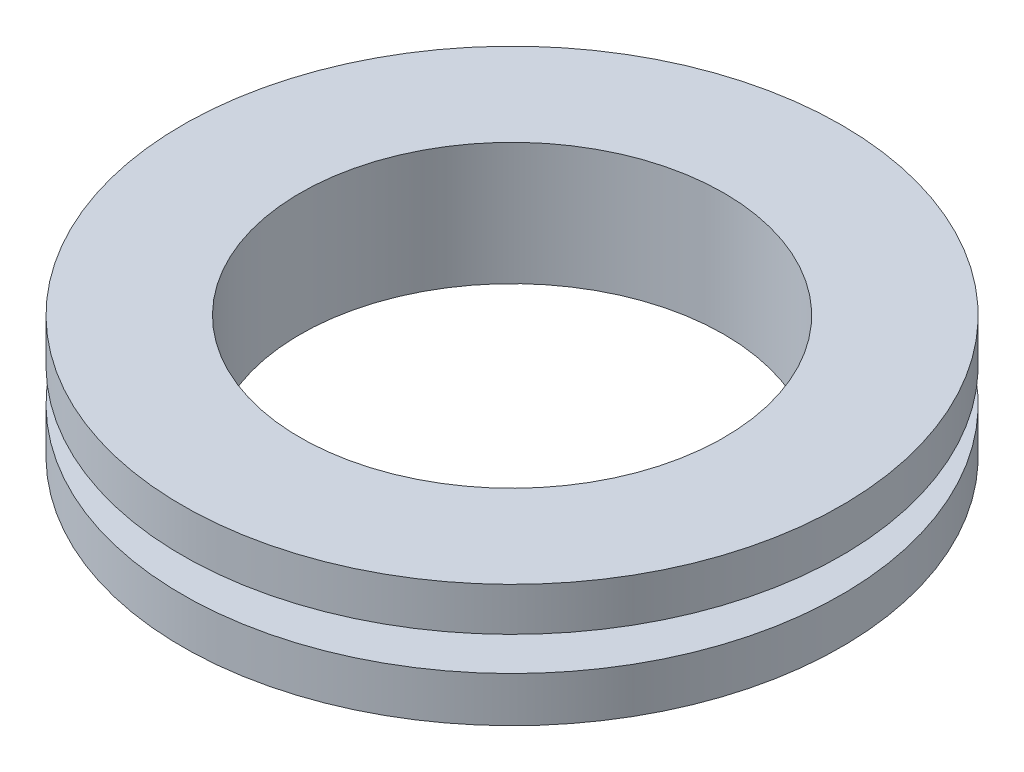
ISO-10303-21;
HEADER;
FILE_DESCRIPTION(('STEP AP214'),'2;1');
FILE_NAME('part.step','',(''),(''),'','','');
FILE_SCHEMA(('AUTOMOTIVE_DESIGN { 1 0 10303 214 1 1 1 1 }'));
ENDSEC;
DATA;
#1=APPLICATION_CONTEXT('core data for automotive mechanical design processes');
#2=APPLICATION_PROTOCOL_DEFINITION('international standard','automotive_design',2000,#1);
#3=PRODUCT_CONTEXT('',#1,'mechanical');
#4=PRODUCT('Part','Part','',(#3));
#5=PRODUCT_RELATED_PRODUCT_CATEGORY('part','',(#4));
#6=PRODUCT_DEFINITION_FORMATION('','',#4);
#7=PRODUCT_DEFINITION_CONTEXT('part definition',#1,'design');
#8=PRODUCT_DEFINITION('design','',#6,#7);
#9=PRODUCT_DEFINITION_SHAPE('','',#8);
#10=(LENGTH_UNIT() NAMED_UNIT(*) SI_UNIT(.MILLI.,.METRE.));
#11=(NAMED_UNIT(*) PLANE_ANGLE_UNIT() SI_UNIT($,.RADIAN.));
#12=(NAMED_UNIT(*) SI_UNIT($,.STERADIAN.) SOLID_ANGLE_UNIT());
#13=UNCERTAINTY_MEASURE_WITH_UNIT(LENGTH_MEASURE(1.E-05),#10,'distance_accuracy_value','');
#14=(GEOMETRIC_REPRESENTATION_CONTEXT(3) GLOBAL_UNCERTAINTY_ASSIGNED_CONTEXT((#13)) GLOBAL_UNIT_ASSIGNED_CONTEXT((#10,
#11,#12)) REPRESENTATION_CONTEXT('',''));
#15=CARTESIAN_POINT('',(0.,0.,0.));
#16=DIRECTION('',(0.,0.,1.));
#17=DIRECTION('',(1.,0.,0.));
#18=AXIS2_PLACEMENT_3D('',#15,#16,#17);
#19=CARTESIAN_POINT('',(0.,0.,0.));
#20=DIRECTION('',(0.,-1.,0.));
#21=DIRECTION('',(0.,0.,-1.));
#22=AXIS2_PLACEMENT_3D('',#19,#20,#21);
#23=CYLINDRICAL_SURFACE('',#22,11.25);
#24=CARTESIAN_POINT('',(0.,0.,0.));
#25=DIRECTION('',(0.,-1.,0.));
#26=DIRECTION('',(0.,0.,-1.));
#27=AXIS2_PLACEMENT_3D('',#24,#25,#26);
#28=CIRCLE('',#27,11.25);
#29=CARTESIAN_POINT('',(0.,0.,-11.25));
#30=VERTEX_POINT('',#29);
#31=EDGE_CURVE('E60',#30,#30,#28,.T.);
#32=ORIENTED_EDGE('',*,*,#31,.T.);
#33=EDGE_LOOP('',(#32));
#34=FACE_BOUND('',#33,.T.);
#35=CARTESIAN_POINT('',(0.,6.5,0.));
#36=DIRECTION('',(0.,-1.,0.));
#37=DIRECTION('',(0.,0.,-1.));
#38=AXIS2_PLACEMENT_3D('',#35,#36,#37);
#39=CIRCLE('',#38,11.25);
#40=CARTESIAN_POINT('',(0.,6.5,-11.25));
#41=VERTEX_POINT('',#40);
#42=EDGE_CURVE('E10',#41,#41,#39,.T.);
#43=ORIENTED_EDGE('',*,*,#42,.F.);
#44=EDGE_LOOP('',(#43));
#45=FACE_BOUND('',#44,.T.);
#46=ADVANCED_FACE('F32',(#34,#45),#23,.F.);
#47=CARTESIAN_POINT('',(11.25,6.5,0.));
#48=DIRECTION('',(0.,1.,0.));
#49=DIRECTION('',(0.,0.,1.));
#50=AXIS2_PLACEMENT_3D('',#47,#48,#49);
#51=PLANE('',#50);
#52=ORIENTED_EDGE('',*,*,#42,.T.);
#53=EDGE_LOOP('',(#52));
#54=FACE_BOUND('',#53,.T.);
#55=CARTESIAN_POINT('',(0.,6.5,0.));
#56=DIRECTION('',(0.,-1.,0.));
#57=DIRECTION('',(0.,0.,-1.));
#58=AXIS2_PLACEMENT_3D('',#55,#56,#57);
#59=CIRCLE('',#58,17.5);
#60=CARTESIAN_POINT('',(0.,6.5,-17.5));
#61=VERTEX_POINT('',#60);
#62=EDGE_CURVE('E38',#61,#61,#59,.T.);
#63=ORIENTED_EDGE('',*,*,#62,.F.);
#64=EDGE_LOOP('',(#63));
#65=FACE_BOUND('',#64,.T.);
#66=ADVANCED_FACE('F78',(#54,#65),#51,.T.);
#67=CARTESIAN_POINT('',(0.,0.,0.));
#68=DIRECTION('',(0.,-1.,0.));
#69=DIRECTION('',(0.,0.,-1.));
#70=AXIS2_PLACEMENT_3D('',#67,#68,#69);
#71=CYLINDRICAL_SURFACE('',#70,17.5);
#72=ORIENTED_EDGE('',*,*,#62,.T.);
#73=EDGE_LOOP('',(#72));
#74=FACE_BOUND('',#73,.T.);
#75=CARTESIAN_POINT('',(0.,4.2,0.));
#76=DIRECTION('',(0.,-1.,0.));
#77=DIRECTION('',(0.,0.,-1.));
#78=AXIS2_PLACEMENT_3D('',#75,#76,#77);
#79=CIRCLE('',#78,17.5);
#80=CARTESIAN_POINT('',(0.,4.2,-17.5));
#81=VERTEX_POINT('',#80);
#82=EDGE_CURVE('E42',#81,#81,#79,.T.);
#83=ORIENTED_EDGE('',*,*,#82,.F.);
#84=EDGE_LOOP('',(#83));
#85=FACE_BOUND('',#84,.T.);
#86=ADVANCED_FACE('F82',(#74,#85),#71,.T.);
#87=CARTESIAN_POINT('',(14.75,4.2,0.));
#88=DIRECTION('',(0.,-1.,0.));
#89=DIRECTION('',(0.,0.,-1.));
#90=AXIS2_PLACEMENT_3D('',#87,#88,#89);
#91=PLANE('',#90);
#92=ORIENTED_EDGE('',*,*,#82,.T.);
#93=EDGE_LOOP('',(#92));
#94=FACE_BOUND('',#93,.T.);
#95=CARTESIAN_POINT('',(0.,4.2,0.));
#96=DIRECTION('',(0.,-1.,0.));
#97=DIRECTION('',(0.,0.,-1.));
#98=AXIS2_PLACEMENT_3D('',#95,#96,#97);
#99=CIRCLE('',#98,14.75);
#100=CARTESIAN_POINT('',(0.,4.2,-14.75));
#101=VERTEX_POINT('',#100);
#102=EDGE_CURVE('E46',#101,#101,#99,.T.);
#103=ORIENTED_EDGE('',*,*,#102,.F.);
#104=EDGE_LOOP('',(#103));
#105=FACE_BOUND('',#104,.T.);
#106=ADVANCED_FACE('F86',(#94,#105),#91,.T.);
#107=CARTESIAN_POINT('',(0.,0.,0.));
#108=DIRECTION('',(0.,-1.,0.));
#109=DIRECTION('',(0.,0.,-1.));
#110=AXIS2_PLACEMENT_3D('',#107,#108,#109);
#111=CYLINDRICAL_SURFACE('',#110,14.75);
#112=ORIENTED_EDGE('',*,*,#102,.T.);
#113=EDGE_LOOP('',(#112));
#114=FACE_BOUND('',#113,.T.);
#115=CARTESIAN_POINT('',(0.,2.4,0.));
#116=DIRECTION('',(0.,-1.,0.));
#117=DIRECTION('',(0.,0.,-1.));
#118=AXIS2_PLACEMENT_3D('',#115,#116,#117);
#119=CIRCLE('',#118,14.75);
#120=CARTESIAN_POINT('',(0.,2.4,-14.75));
#121=VERTEX_POINT('',#120);
#122=EDGE_CURVE('E51',#121,#121,#119,.T.);
#123=ORIENTED_EDGE('',*,*,#122,.F.);
#124=EDGE_LOOP('',(#123));
#125=FACE_BOUND('',#124,.T.);
#126=ADVANCED_FACE('F92',(#114,#125),#111,.T.);
#127=CARTESIAN_POINT('',(17.5,2.4,0.));
#128=DIRECTION('',(0.,1.,0.));
#129=DIRECTION('',(0.,0.,1.));
#130=AXIS2_PLACEMENT_3D('',#127,#128,#129);
#131=PLANE('',#130);
#132=ORIENTED_EDGE('',*,*,#122,.T.);
#133=EDGE_LOOP('',(#132));
#134=FACE_BOUND('',#133,.T.);
#135=CARTESIAN_POINT('',(0.,2.4,0.));
#136=DIRECTION('',(0.,-1.,0.));
#137=DIRECTION('',(0.,0.,-1.));
#138=AXIS2_PLACEMENT_3D('',#135,#136,#137);
#139=CIRCLE('',#138,17.5);
#140=CARTESIAN_POINT('',(0.,2.4,-17.5));
#141=VERTEX_POINT('',#140);
#142=EDGE_CURVE('E54',#141,#141,#139,.T.);
#143=ORIENTED_EDGE('',*,*,#142,.F.);
#144=EDGE_LOOP('',(#143));
#145=FACE_BOUND('',#144,.T.);
#146=ADVANCED_FACE('F74',(#134,#145),#131,.T.);
#147=CARTESIAN_POINT('',(0.,0.,0.));
#148=DIRECTION('',(0.,-1.,0.));
#149=DIRECTION('',(0.,0.,-1.));
#150=AXIS2_PLACEMENT_3D('',#147,#148,#149);
#151=CYLINDRICAL_SURFACE('',#150,17.5);
#152=ORIENTED_EDGE('',*,*,#142,.T.);
#153=EDGE_LOOP('',(#152));
#154=FACE_BOUND('',#153,.T.);
#155=CARTESIAN_POINT('',(0.,0.,0.));
#156=DIRECTION('',(0.,-1.,0.));
#157=DIRECTION('',(0.,0.,-1.));
#158=AXIS2_PLACEMENT_3D('',#155,#156,#157);
#159=CIRCLE('',#158,17.5);
#160=CARTESIAN_POINT('',(0.,0.,-17.5));
#161=VERTEX_POINT('',#160);
#162=EDGE_CURVE('E57',#161,#161,#159,.T.);
#163=ORIENTED_EDGE('',*,*,#162,.F.);
#164=EDGE_LOOP('',(#163));
#165=FACE_BOUND('',#164,.T.);
#166=ADVANCED_FACE('F68',(#154,#165),#151,.T.);
#167=CARTESIAN_POINT('',(11.25,0.,0.));
#168=DIRECTION('',(0.,-1.,0.));
#169=DIRECTION('',(0.,0.,-1.));
#170=AXIS2_PLACEMENT_3D('',#167,#168,#169);
#171=PLANE('',#170);
#172=ORIENTED_EDGE('',*,*,#162,.T.);
#173=EDGE_LOOP('',(#172));
#174=FACE_BOUND('',#173,.T.);
#175=ORIENTED_EDGE('',*,*,#31,.F.);
#176=EDGE_LOOP('',(#175));
#177=FACE_BOUND('',#176,.T.);
#178=ADVANCED_FACE('F66',(#174,#177),#171,.T.);
#179=CLOSED_SHELL('',(#46,#66,#86,#106,#126,#146,#166,#178));
#180=MANIFOLD_SOLID_BREP('B2',#179);
#181=ADVANCED_BREP_SHAPE_REPRESENTATION('',(#18,#180),#14);
#182=SHAPE_DEFINITION_REPRESENTATION(#9,#181);
ENDSEC;
END-ISO-10303-21;
